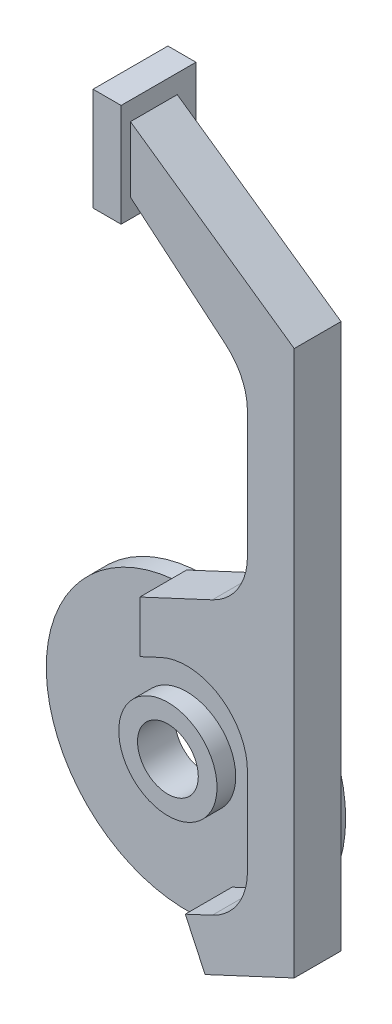
ISO-10303-21;
HEADER;
FILE_DESCRIPTION(('STEP AP214'),'2;1');
FILE_NAME('part.step','',(''),(''),'','','');
FILE_SCHEMA(('AUTOMOTIVE_DESIGN { 1 0 10303 214 1 1 1 1 }'));
ENDSEC;
DATA;
#1=APPLICATION_CONTEXT('core data for automotive mechanical design processes');
#2=APPLICATION_PROTOCOL_DEFINITION('international standard','automotive_design',2000,#1);
#3=PRODUCT_CONTEXT('',#1,'mechanical');
#4=PRODUCT('Part','Part','',(#3));
#5=PRODUCT_RELATED_PRODUCT_CATEGORY('part','',(#4));
#6=PRODUCT_DEFINITION_FORMATION('','',#4);
#7=PRODUCT_DEFINITION_CONTEXT('part definition',#1,'design');
#8=PRODUCT_DEFINITION('design','',#6,#7);
#9=PRODUCT_DEFINITION_SHAPE('','',#8);
#10=(LENGTH_UNIT() NAMED_UNIT(*) SI_UNIT(.MILLI.,.METRE.));
#11=(NAMED_UNIT(*) PLANE_ANGLE_UNIT() SI_UNIT($,.RADIAN.));
#12=(NAMED_UNIT(*) SI_UNIT($,.STERADIAN.) SOLID_ANGLE_UNIT());
#13=UNCERTAINTY_MEASURE_WITH_UNIT(LENGTH_MEASURE(1.E-05),#10,'distance_accuracy_value','');
#14=(GEOMETRIC_REPRESENTATION_CONTEXT(3) GLOBAL_UNCERTAINTY_ASSIGNED_CONTEXT((#13)) GLOBAL_UNIT_ASSIGNED_CONTEXT((#10,
#11,#12)) REPRESENTATION_CONTEXT('',''));
#15=CARTESIAN_POINT('',(0.,0.,0.));
#16=DIRECTION('',(0.,0.,1.));
#17=DIRECTION('',(1.,0.,0.));
#18=AXIS2_PLACEMENT_3D('',#15,#16,#17);
#19=CARTESIAN_POINT('',(0.,0.,4.));
#20=DIRECTION('',(0.,0.,-1.));
#21=DIRECTION('',(-1.,0.,0.));
#22=AXIS2_PLACEMENT_3D('',#19,#20,#21);
#23=CYLINDRICAL_SURFACE('',#22,30.);
#24=CARTESIAN_POINT('',(0.,0.,4.));
#25=DIRECTION('',(0.,0.,1.));
#26=DIRECTION('',(1.,0.,0.));
#27=AXIS2_PLACEMENT_3D('',#24,#25,#26);
#28=CIRCLE('',#27,30.);
#29=CARTESIAN_POINT('',(0.,30.,4.));
#30=VERTEX_POINT('',#29);
#31=CARTESIAN_POINT('',(12.678547852221,-27.1892336110995,4.));
#32=VERTEX_POINT('',#31);
#33=EDGE_CURVE('E53',#30,#32,#28,.T.);
#34=ORIENTED_EDGE('',*,*,#33,.F.);
#35=EDGE_CURVE('E334',#32,#30,#28,.T.);
#36=ORIENTED_EDGE('',*,*,#35,.F.);
#37=EDGE_LOOP('',(#34,#36));
#38=FACE_BOUND('',#37,.T.);
#39=CARTESIAN_POINT('',(0.,0.,0.));
#40=DIRECTION('',(0.,0.,1.));
#41=DIRECTION('',(1.,0.,0.));
#42=AXIS2_PLACEMENT_3D('',#39,#40,#41);
#43=CIRCLE('',#42,30.);
#44=CARTESIAN_POINT('',(30.,0.,0.));
#45=VERTEX_POINT('',#44);
#46=EDGE_CURVE('E333',#45,#45,#43,.T.);
#47=ORIENTED_EDGE('',*,*,#46,.T.);
#48=EDGE_LOOP('',(#47));
#49=FACE_BOUND('',#48,.T.);
#50=ADVANCED_FACE('F45',(#38,#49),#23,.T.);
#51=CARTESIAN_POINT('',(0.,0.,4.));
#52=DIRECTION('',(0.,0.,1.));
#53=DIRECTION('',(1.,0.,0.));
#54=AXIS2_PLACEMENT_3D('',#51,#52,#53);
#55=PLANE('',#54);
#56=CARTESIAN_POINT('',(0.,0.,4.));
#57=DIRECTION('',(0.,0.,1.));
#58=DIRECTION('',(1.,0.,0.));
#59=AXIS2_PLACEMENT_3D('',#56,#57,#58);
#60=CIRCLE('',#59,10.5);
#61=CARTESIAN_POINT('',(10.5,0.,4.));
#62=VERTEX_POINT('',#61);
#63=EDGE_CURVE('E494',#62,#62,#60,.T.);
#64=ORIENTED_EDGE('',*,*,#63,.F.);
#65=EDGE_LOOP('',(#64));
#66=FACE_BOUND('',#65,.T.);
#67=DIRECTION('',(0.,-1.,0.));
#68=VECTOR('',#67,1.);
#69=CARTESIAN_POINT('',(0.,33.,4.));
#70=LINE('',#69,#68);
#71=CARTESIAN_POINT('',(0.,21.9662208103751,4.));
#72=VERTEX_POINT('',#71);
#73=EDGE_CURVE('E11',#30,#72,#70,.T.);
#74=ORIENTED_EDGE('',*,*,#73,.F.);
#75=ORIENTED_EDGE('',*,*,#33,.T.);
#76=DIRECTION('',(0.422618261740701,-0.906307787036649,0.));
#77=VECTOR('',#76,1.);
#78=CARTESIAN_POINT('',(9.72022002003613,-20.8450791018429,4.));
#79=LINE('',#78,#77);
#80=CARTESIAN_POINT('',(9.72022002003613,-20.8450791018429,4.));
#81=VERTEX_POINT('',#80);
#82=EDGE_CURVE('E256',#81,#32,#79,.T.);
#83=ORIENTED_EDGE('',*,*,#82,.F.);
#84=DIRECTION('',(-0.906307787036648,-0.422618261740704,0.));
#85=VECTOR('',#84,1.);
#86=CARTESIAN_POINT('',(15.4940374026292,-18.1527038395513,4.));
#87=LINE('',#86,#85);
#88=CARTESIAN_POINT('',(15.4940374026292,-18.1527038395513,4.));
#89=VERTEX_POINT('',#88);
#90=EDGE_CURVE('E212',#89,#81,#87,.T.);
#91=ORIENTED_EDGE('',*,*,#90,.F.);
#92=CARTESIAN_POINT('',(10.,-6.37070260807489,4.));
#93=DIRECTION('',(0.,0.,-1.));
#94=DIRECTION('',(-1.,0.,0.));
#95=AXIS2_PLACEMENT_3D('',#92,#93,#94);
#96=CIRCLE('',#95,13.);
#97=CARTESIAN_POINT('',(23.,-6.37070260807489,4.));
#98=VERTEX_POINT('',#97);
#99=EDGE_CURVE('E225',#98,#89,#96,.T.);
#100=ORIENTED_EDGE('',*,*,#99,.F.);
#101=DIRECTION('',(0.,-1.,0.));
#102=VECTOR('',#101,1.);
#103=CARTESIAN_POINT('',(23.,12.2853844454127,4.));
#104=LINE('',#103,#102);
#105=CARTESIAN_POINT('',(23.,12.2853844454127,4.));
#106=VERTEX_POINT('',#105);
#107=EDGE_CURVE('E282',#106,#98,#104,.T.);
#108=ORIENTED_EDGE('',*,*,#107,.F.);
#109=CARTESIAN_POINT('',(10.,12.2853844454127,4.));
#110=DIRECTION('',(0.,0.,-1.));
#111=DIRECTION('',(-1.,0.,0.));
#112=AXIS2_PLACEMENT_3D('',#109,#110,#111);
#113=CIRCLE('',#112,13.);
#114=CARTESIAN_POINT('',(4.50596259737085,24.0673856768891,4.));
#115=VERTEX_POINT('',#114);
#116=EDGE_CURVE('E66',#115,#106,#113,.T.);
#117=ORIENTED_EDGE('',*,*,#116,.F.);
#118=DIRECTION('',(0.906307787036647,0.422618261740705,0.));
#119=VECTOR('',#118,1.);
#120=CARTESIAN_POINT('',(0.,21.9662208103751,4.));
#121=LINE('',#120,#119);
#122=EDGE_CURVE('E62',#72,#115,#121,.T.);
#123=ORIENTED_EDGE('',*,*,#122,.F.);
#124=EDGE_LOOP('',(#74,#75,#83,#91,#100,#108,#117,#123));
#125=FACE_BOUND('',#124,.T.);
#126=ADVANCED_FACE('F396',(#66,#125),#55,.T.);
#127=CARTESIAN_POINT('',(0.,0.,0.));
#128=DIRECTION('',(0.,0.,1.));
#129=DIRECTION('',(1.,0.,0.));
#130=AXIS2_PLACEMENT_3D('',#127,#128,#129);
#131=PLANE('',#130);
#132=CARTESIAN_POINT('',(0.,0.,0.));
#133=DIRECTION('',(0.,0.,1.));
#134=DIRECTION('',(1.,0.,0.));
#135=AXIS2_PLACEMENT_3D('',#132,#133,#134);
#136=CIRCLE('',#135,6.5);
#137=CARTESIAN_POINT('',(6.5,0.,0.));
#138=VERTEX_POINT('',#137);
#139=EDGE_CURVE('E492',#138,#138,#136,.T.);
#140=ORIENTED_EDGE('',*,*,#139,.T.);
#141=EDGE_LOOP('',(#140));
#142=FACE_BOUND('',#141,.T.);
#143=ORIENTED_EDGE('',*,*,#46,.F.);
#144=EDGE_LOOP('',(#143));
#145=FACE_BOUND('',#144,.T.);
#146=ADVANCED_FACE('F402',(#142,#145),#131,.F.);
#147=CARTESIAN_POINT('',(15.4940374026292,-18.1527038395513,14.));
#148=DIRECTION('',(0.422618261740704,-0.906307787036648,0.));
#149=DIRECTION('',(0.906307787036648,0.422618261740704,0.));
#150=AXIS2_PLACEMENT_3D('',#147,#148,#149);
#151=PLANE('',#150);
#152=ORIENTED_EDGE('',*,*,#90,.T.);
#153=DIRECTION('',(0.,0.,-1.));
#154=VECTOR('',#153,1.);
#155=CARTESIAN_POINT('',(9.72022002003613,-20.8450791018429,14.));
#156=LINE('',#155,#154);
#157=CARTESIAN_POINT('',(9.72022002003613,-20.8450791018429,14.));
#158=VERTEX_POINT('',#157);
#159=EDGE_CURVE('E330',#158,#81,#156,.T.);
#160=ORIENTED_EDGE('',*,*,#159,.F.);
#161=DIRECTION('',(-0.906307787036648,-0.422618261740704,0.));
#162=VECTOR('',#161,1.);
#163=CARTESIAN_POINT('',(15.4940374026292,-18.1527038395513,14.));
#164=LINE('',#163,#162);
#165=CARTESIAN_POINT('',(15.4940374026292,-18.1527038395513,14.));
#166=VERTEX_POINT('',#165);
#167=EDGE_CURVE('E221',#166,#158,#164,.T.);
#168=ORIENTED_EDGE('',*,*,#167,.F.);
#169=DIRECTION('',(0.,0.,-1.));
#170=VECTOR('',#169,1.);
#171=CARTESIAN_POINT('',(15.4940374026292,-18.1527038395513,14.));
#172=LINE('',#171,#170);
#173=EDGE_CURVE('E254',#166,#89,#172,.T.);
#174=ORIENTED_EDGE('',*,*,#173,.T.);
#175=EDGE_LOOP('',(#152,#160,#168,#174));
#176=FACE_BOUND('',#175,.T.);
#177=ADVANCED_FACE('F410',(#176),#151,.F.);
#178=CARTESIAN_POINT('',(9.72022002003613,-20.8450791018429,14.));
#179=DIRECTION('',(0.906307787036649,0.422618261740701,0.));
#180=DIRECTION('',(-0.422618261740701,0.906307787036649,0.));
#181=AXIS2_PLACEMENT_3D('',#178,#179,#180);
#182=PLANE('',#181);
#183=ORIENTED_EDGE('',*,*,#82,.T.);
#184=CARTESIAN_POINT('',(13.9464026374431,-29.9081569722094,4.));
#185=VERTEX_POINT('',#184);
#186=EDGE_CURVE('E215',#32,#185,#79,.T.);
#187=ORIENTED_EDGE('',*,*,#186,.T.);
#188=DIRECTION('',(0.,0.,-1.));
#189=VECTOR('',#188,1.);
#190=CARTESIAN_POINT('',(13.9464026374431,-29.9081569722094,14.));
#191=LINE('',#190,#189);
#192=CARTESIAN_POINT('',(13.9464026374431,-29.9081569722094,14.));
#193=VERTEX_POINT('',#192);
#194=EDGE_CURVE('E327',#193,#185,#191,.T.);
#195=ORIENTED_EDGE('',*,*,#194,.F.);
#196=DIRECTION('',(0.422618261740701,-0.906307787036649,0.));
#197=VECTOR('',#196,1.);
#198=CARTESIAN_POINT('',(9.72022002003613,-20.8450791018429,14.));
#199=LINE('',#198,#197);
#200=EDGE_CURVE('E224',#158,#193,#199,.T.);
#201=ORIENTED_EDGE('',*,*,#200,.F.);
#202=ORIENTED_EDGE('',*,*,#159,.T.);
#203=EDGE_LOOP('',(#183,#187,#195,#201,#202));
#204=FACE_BOUND('',#203,.T.);
#205=ADVANCED_FACE('F394',(#204),#182,.F.);
#206=CARTESIAN_POINT('',(13.9464026374431,-29.9081569722094,14.));
#207=DIRECTION('',(-0.422618261740704,0.906307787036648,0.));
#208=DIRECTION('',(-0.906307787036648,-0.422618261740704,0.));
#209=AXIS2_PLACEMENT_3D('',#206,#207,#208);
#210=PLANE('',#209);
#211=DIRECTION('',(0.906307787036648,0.422618261740704,0.));
#212=VECTOR('',#211,1.);
#213=CARTESIAN_POINT('',(13.9464026374431,-29.9081569722094,4.));
#214=LINE('',#213,#212);
#215=CARTESIAN_POINT('',(33.,-21.0233186066472,4.));
#216=VERTEX_POINT('',#215);
#217=EDGE_CURVE('E259',#185,#216,#214,.T.);
#218=ORIENTED_EDGE('',*,*,#217,.T.);
#219=DIRECTION('',(0.,0.,-1.));
#220=VECTOR('',#219,1.);
#221=CARTESIAN_POINT('',(33.,-21.0233186066472,14.));
#222=LINE('',#221,#220);
#223=CARTESIAN_POINT('',(33.,-21.0233186066472,14.));
#224=VERTEX_POINT('',#223);
#225=EDGE_CURVE('E324',#224,#216,#222,.T.);
#226=ORIENTED_EDGE('',*,*,#225,.F.);
#227=DIRECTION('',(0.906307787036648,0.422618261740704,0.));
#228=VECTOR('',#227,1.);
#229=CARTESIAN_POINT('',(13.9464026374431,-29.9081569722094,14.));
#230=LINE('',#229,#228);
#231=EDGE_CURVE('E227',#193,#224,#230,.T.);
#232=ORIENTED_EDGE('',*,*,#231,.F.);
#233=ORIENTED_EDGE('',*,*,#194,.T.);
#234=EDGE_LOOP('',(#218,#226,#232,#233));
#235=FACE_BOUND('',#234,.T.);
#236=ADVANCED_FACE('F391',(#235),#210,.F.);
#237=CARTESIAN_POINT('',(33.,-21.0233186066472,14.));
#238=DIRECTION('',(-1.,0.,0.));
#239=DIRECTION('',(0.,0.,1.));
#240=AXIS2_PLACEMENT_3D('',#237,#238,#239);
#241=PLANE('',#240);
#242=DIRECTION('',(0.,1.,0.));
#243=VECTOR('',#242,1.);
#244=CARTESIAN_POINT('',(33.,-21.0233186066472,4.));
#245=LINE('',#244,#243);
#246=CARTESIAN_POINT('',(33.,95.4927361626601,4.));
#247=VERTEX_POINT('',#246);
#248=EDGE_CURVE('E261',#216,#247,#245,.T.);
#249=ORIENTED_EDGE('',*,*,#248,.T.);
#250=DIRECTION('',(0.,0.,-1.));
#251=VECTOR('',#250,1.);
#252=CARTESIAN_POINT('',(33.,95.4927361626601,14.));
#253=LINE('',#252,#251);
#254=CARTESIAN_POINT('',(33.,95.4927361626601,14.));
#255=VERTEX_POINT('',#254);
#256=EDGE_CURVE('E321',#255,#247,#253,.T.);
#257=ORIENTED_EDGE('',*,*,#256,.F.);
#258=DIRECTION('',(0.,1.,0.));
#259=VECTOR('',#258,1.);
#260=CARTESIAN_POINT('',(33.,-21.0233186066472,14.));
#261=LINE('',#260,#259);
#262=EDGE_CURVE('E229',#224,#255,#261,.T.);
#263=ORIENTED_EDGE('',*,*,#262,.F.);
#264=ORIENTED_EDGE('',*,*,#225,.T.);
#265=EDGE_LOOP('',(#249,#257,#263,#264));
#266=FACE_BOUND('',#265,.T.);
#267=ADVANCED_FACE('F386',(#266),#241,.F.);
#268=CARTESIAN_POINT('',(33.,95.4927361626601,14.));
#269=DIRECTION('',(-0.573576436351047,-0.819152044288991,0.));
#270=DIRECTION('',(0.819152044288991,-0.573576436351047,0.));
#271=AXIS2_PLACEMENT_3D('',#268,#269,#270);
#272=PLANE('',#271);
#273=DIRECTION('',(-0.819152044288991,0.573576436351047,0.));
#274=VECTOR('',#273,1.);
#275=CARTESIAN_POINT('',(33.,95.4927361626601,4.));
#276=LINE('',#275,#274);
#277=CARTESIAN_POINT('',(-2.,120.,4.));
#278=VERTEX_POINT('',#277);
#279=EDGE_CURVE('E263',#247,#278,#276,.T.);
#280=ORIENTED_EDGE('',*,*,#279,.T.);
#281=DIRECTION('',(0.,0.,-1.));
#282=VECTOR('',#281,1.);
#283=CARTESIAN_POINT('',(-2.,120.,14.));
#284=LINE('',#283,#282);
#285=CARTESIAN_POINT('',(-2.,120.,14.));
#286=VERTEX_POINT('',#285);
#287=EDGE_CURVE('E318',#286,#278,#284,.T.);
#288=ORIENTED_EDGE('',*,*,#287,.F.);
#289=DIRECTION('',(-0.819152044288991,0.573576436351047,0.));
#290=VECTOR('',#289,1.);
#291=CARTESIAN_POINT('',(33.,95.4927361626601,14.));
#292=LINE('',#291,#290);
#293=EDGE_CURVE('E231',#255,#286,#292,.T.);
#294=ORIENTED_EDGE('',*,*,#293,.F.);
#295=ORIENTED_EDGE('',*,*,#256,.T.);
#296=EDGE_LOOP('',(#280,#288,#294,#295));
#297=FACE_BOUND('',#296,.T.);
#298=ADVANCED_FACE('F382',(#297),#272,.F.);
#299=CARTESIAN_POINT('',(-2.,106.,14.));
#300=DIRECTION('',(0.642787609686535,0.766044443118982,0.));
#301=DIRECTION('',(-0.766044443118982,0.642787609686535,0.));
#302=AXIS2_PLACEMENT_3D('',#299,#300,#301);
#303=PLANE('',#302);
#304=DIRECTION('',(0.766044443118982,-0.642787609686535,0.));
#305=VECTOR('',#304,1.);
#306=CARTESIAN_POINT('',(-2.,106.,4.));
#307=LINE('',#306,#305);
#308=CARTESIAN_POINT('',(-2.,106.,4.));
#309=VERTEX_POINT('',#308);
#310=CARTESIAN_POINT('',(18.3562389259249,88.9190874251,4.));
#311=VERTEX_POINT('',#310);
#312=EDGE_CURVE('E269',#309,#311,#307,.T.);
#313=ORIENTED_EDGE('',*,*,#312,.T.);
#314=DIRECTION('',(0.,0.,-1.));
#315=VECTOR('',#314,1.);
#316=CARTESIAN_POINT('',(18.3562389259249,88.9190874251,14.));
#317=LINE('',#316,#315);
#318=CARTESIAN_POINT('',(18.3562389259249,88.9190874251,14.));
#319=VERTEX_POINT('',#318);
#320=EDGE_CURVE('E313',#319,#311,#317,.T.);
#321=ORIENTED_EDGE('',*,*,#320,.F.);
#322=DIRECTION('',(0.766044443118982,-0.642787609686535,0.));
#323=VECTOR('',#322,1.);
#324=CARTESIAN_POINT('',(-2.,106.,14.));
#325=LINE('',#324,#323);
#326=CARTESIAN_POINT('',(-2.,106.,14.));
#327=VERTEX_POINT('',#326);
#328=EDGE_CURVE('E235',#327,#319,#325,.T.);
#329=ORIENTED_EDGE('',*,*,#328,.F.);
#330=DIRECTION('',(0.,0.,-1.));
#331=VECTOR('',#330,1.);
#332=CARTESIAN_POINT('',(-2.,106.,14.));
#333=LINE('',#332,#331);
#334=EDGE_CURVE('E316',#327,#309,#333,.T.);
#335=ORIENTED_EDGE('',*,*,#334,.T.);
#336=EDGE_LOOP('',(#313,#321,#329,#335));
#337=FACE_BOUND('',#336,.T.);
#338=ADVANCED_FACE('F424',(#337),#303,.F.);
#339=CARTESIAN_POINT('',(9.99999999999999,78.9605096645532,14.));
#340=DIRECTION('',(0.,0.,-1.));
#341=DIRECTION('',(-1.,0.,0.));
#342=AXIS2_PLACEMENT_3D('',#339,#340,#341);
#343=CYLINDRICAL_SURFACE('',#342,13.);
#344=CARTESIAN_POINT('',(9.99999999999999,78.9605096645532,4.));
#345=DIRECTION('',(0.,0.,-1.));
#346=DIRECTION('',(-1.,0.,0.));
#347=AXIS2_PLACEMENT_3D('',#344,#345,#346);
#348=CIRCLE('',#347,13.);
#349=CARTESIAN_POINT('',(23.,78.9605096645532,4.));
#350=VERTEX_POINT('',#349);
#351=EDGE_CURVE('E271',#311,#350,#348,.T.);
#352=ORIENTED_EDGE('',*,*,#351,.T.);
#353=DIRECTION('',(0.,0.,-1.));
#354=VECTOR('',#353,1.);
#355=CARTESIAN_POINT('',(23.,78.9605096645532,14.));
#356=LINE('',#355,#354);
#357=CARTESIAN_POINT('',(23.,78.9605096645532,14.));
#358=VERTEX_POINT('',#357);
#359=EDGE_CURVE('E310',#358,#350,#356,.T.);
#360=ORIENTED_EDGE('',*,*,#359,.F.);
#361=CARTESIAN_POINT('',(9.99999999999999,78.9605096645532,14.));
#362=DIRECTION('',(0.,0.,-1.));
#363=DIRECTION('',(-1.,0.,0.));
#364=AXIS2_PLACEMENT_3D('',#361,#362,#363);
#365=CIRCLE('',#364,13.);
#366=EDGE_CURVE('E237',#319,#358,#365,.T.);
#367=ORIENTED_EDGE('',*,*,#366,.F.);
#368=ORIENTED_EDGE('',*,*,#320,.T.);
#369=EDGE_LOOP('',(#352,#360,#367,#368));
#370=FACE_BOUND('',#369,.T.);
#371=ADVANCED_FACE('F370',(#370),#343,.F.);
#372=CARTESIAN_POINT('',(23.,78.9605096645532,14.));
#373=DIRECTION('',(1.,0.,0.));
#374=DIRECTION('',(0.,0.,-1.));
#375=AXIS2_PLACEMENT_3D('',#372,#373,#374);
#376=PLANE('',#375);
#377=DIRECTION('',(0.,-1.,0.));
#378=VECTOR('',#377,1.);
#379=CARTESIAN_POINT('',(23.,78.9605096645532,4.));
#380=LINE('',#379,#378);
#381=CARTESIAN_POINT('',(23.,52.0069895280625,4.));
#382=VERTEX_POINT('',#381);
#383=EDGE_CURVE('E273',#350,#382,#380,.T.);
#384=ORIENTED_EDGE('',*,*,#383,.T.);
#385=DIRECTION('',(0.,0.,-1.));
#386=VECTOR('',#385,1.);
#387=CARTESIAN_POINT('',(23.,52.0069895280625,14.));
#388=LINE('',#387,#386);
#389=CARTESIAN_POINT('',(23.,52.0069895280625,14.));
#390=VERTEX_POINT('',#389);
#391=EDGE_CURVE('E307',#390,#382,#388,.T.);
#392=ORIENTED_EDGE('',*,*,#391,.F.);
#393=DIRECTION('',(0.,-1.,0.));
#394=VECTOR('',#393,1.);
#395=CARTESIAN_POINT('',(23.,78.9605096645532,14.));
#396=LINE('',#395,#394);
#397=EDGE_CURVE('E239',#358,#390,#396,.T.);
#398=ORIENTED_EDGE('',*,*,#397,.F.);
#399=ORIENTED_EDGE('',*,*,#359,.T.);
#400=EDGE_LOOP('',(#384,#392,#398,#399));
#401=FACE_BOUND('',#400,.T.);
#402=ADVANCED_FACE('F366',(#401),#376,.F.);
#403=CARTESIAN_POINT('',(9.99999999999999,52.0069895280625,14.));
#404=DIRECTION('',(0.,0.,-1.));
#405=DIRECTION('',(-1.,0.,0.));
#406=AXIS2_PLACEMENT_3D('',#403,#404,#405);
#407=CYLINDRICAL_SURFACE('',#406,13.);
#408=CARTESIAN_POINT('',(9.99999999999999,52.0069895280625,4.));
#409=DIRECTION('',(0.,0.,-1.));
#410=DIRECTION('',(-1.,0.,0.));
#411=AXIS2_PLACEMENT_3D('',#408,#409,#410);
#412=CIRCLE('',#411,13.);
#413=CARTESIAN_POINT('',(15.4940374026291,40.224988296586,4.));
#414=VERTEX_POINT('',#413);
#415=EDGE_CURVE('E275',#382,#414,#412,.T.);
#416=ORIENTED_EDGE('',*,*,#415,.T.);
#417=DIRECTION('',(0.,0.,-1.));
#418=VECTOR('',#417,1.);
#419=CARTESIAN_POINT('',(15.4940374026291,40.224988296586,14.));
#420=LINE('',#419,#418);
#421=CARTESIAN_POINT('',(15.4940374026291,40.224988296586,14.));
#422=VERTEX_POINT('',#421);
#423=EDGE_CURVE('E304',#422,#414,#420,.T.);
#424=ORIENTED_EDGE('',*,*,#423,.F.);
#425=CARTESIAN_POINT('',(9.99999999999999,52.0069895280625,14.));
#426=DIRECTION('',(0.,0.,-1.));
#427=DIRECTION('',(-1.,0.,0.));
#428=AXIS2_PLACEMENT_3D('',#425,#426,#427);
#429=CIRCLE('',#428,13.);
#430=EDGE_CURVE('E241',#390,#422,#429,.T.);
#431=ORIENTED_EDGE('',*,*,#430,.F.);
#432=ORIENTED_EDGE('',*,*,#391,.T.);
#433=EDGE_LOOP('',(#416,#424,#431,#432));
#434=FACE_BOUND('',#433,.T.);
#435=ADVANCED_FACE('F361',(#434),#407,.F.);
#436=CARTESIAN_POINT('',(15.4940374026291,40.224988296586,14.));
#437=DIRECTION('',(0.422618261740704,-0.906307787036648,0.));
#438=DIRECTION('',(0.906307787036648,0.422618261740704,0.));
#439=AXIS2_PLACEMENT_3D('',#436,#437,#438);
#440=PLANE('',#439);
#441=DIRECTION('',(-0.906307787036648,-0.422618261740704,0.));
#442=VECTOR('',#441,1.);
#443=CARTESIAN_POINT('',(15.4940374026291,40.224988296586,4.));
#444=LINE('',#443,#442);
#445=CARTESIAN_POINT('',(0.,33.,4.));
#446=VERTEX_POINT('',#445);
#447=EDGE_CURVE('E277',#414,#446,#444,.T.);
#448=ORIENTED_EDGE('',*,*,#447,.T.);
#449=DIRECTION('',(0.,0.,-1.));
#450=VECTOR('',#449,1.);
#451=CARTESIAN_POINT('',(0.,33.,14.));
#452=LINE('',#451,#450);
#453=CARTESIAN_POINT('',(0.,33.,14.));
#454=VERTEX_POINT('',#453);
#455=EDGE_CURVE('E301',#454,#446,#452,.T.);
#456=ORIENTED_EDGE('',*,*,#455,.F.);
#457=DIRECTION('',(-0.906307787036648,-0.422618261740704,0.));
#458=VECTOR('',#457,1.);
#459=CARTESIAN_POINT('',(15.4940374026291,40.224988296586,14.));
#460=LINE('',#459,#458);
#461=EDGE_CURVE('E243',#422,#454,#460,.T.);
#462=ORIENTED_EDGE('',*,*,#461,.F.);
#463=ORIENTED_EDGE('',*,*,#423,.T.);
#464=EDGE_LOOP('',(#448,#456,#462,#463));
#465=FACE_BOUND('',#464,.T.);
#466=ADVANCED_FACE('F355',(#465),#440,.F.);
#467=CARTESIAN_POINT('',(0.,33.,14.));
#468=DIRECTION('',(1.,0.,0.));
#469=DIRECTION('',(0.,1.,0.));
#470=AXIS2_PLACEMENT_3D('',#467,#468,#469);
#471=PLANE('',#470);
#472=EDGE_CURVE('E55',#446,#30,#70,.T.);
#473=ORIENTED_EDGE('',*,*,#472,.T.);
#474=ORIENTED_EDGE('',*,*,#73,.T.);
#475=DIRECTION('',(0.,0.,-1.));
#476=VECTOR('',#475,1.);
#477=CARTESIAN_POINT('',(0.,21.9662208103751,14.));
#478=LINE('',#477,#476);
#479=CARTESIAN_POINT('',(0.,21.9662208103751,14.));
#480=VERTEX_POINT('',#479);
#481=EDGE_CURVE('E298',#480,#72,#478,.T.);
#482=ORIENTED_EDGE('',*,*,#481,.F.);
#483=DIRECTION('',(0.,-1.,0.));
#484=VECTOR('',#483,1.);
#485=CARTESIAN_POINT('',(0.,33.,14.));
#486=LINE('',#485,#484);
#487=EDGE_CURVE('E245',#454,#480,#486,.T.);
#488=ORIENTED_EDGE('',*,*,#487,.F.);
#489=ORIENTED_EDGE('',*,*,#455,.T.);
#490=EDGE_LOOP('',(#473,#474,#482,#488,#489));
#491=FACE_BOUND('',#490,.T.);
#492=ADVANCED_FACE('F349',(#491),#471,.F.);
#493=CARTESIAN_POINT('',(0.,21.9662208103751,14.));
#494=DIRECTION('',(-0.422618261740705,0.906307787036647,0.));
#495=DIRECTION('',(-0.906307787036647,-0.422618261740705,0.));
#496=AXIS2_PLACEMENT_3D('',#493,#494,#495);
#497=PLANE('',#496);
#498=ORIENTED_EDGE('',*,*,#122,.T.);
#499=DIRECTION('',(0.,0.,-1.));
#500=VECTOR('',#499,1.);
#501=CARTESIAN_POINT('',(4.50596259737085,24.0673856768891,14.));
#502=LINE('',#501,#500);
#503=CARTESIAN_POINT('',(4.50596259737085,24.0673856768891,14.));
#504=VERTEX_POINT('',#503);
#505=EDGE_CURVE('E295',#504,#115,#502,.T.);
#506=ORIENTED_EDGE('',*,*,#505,.F.);
#507=DIRECTION('',(0.906307787036647,0.422618261740705,0.));
#508=VECTOR('',#507,1.);
#509=CARTESIAN_POINT('',(0.,21.9662208103751,14.));
#510=LINE('',#509,#508);
#511=EDGE_CURVE('E247',#480,#504,#510,.T.);
#512=ORIENTED_EDGE('',*,*,#511,.F.);
#513=ORIENTED_EDGE('',*,*,#481,.T.);
#514=EDGE_LOOP('',(#498,#506,#512,#513));
#515=FACE_BOUND('',#514,.T.);
#516=ADVANCED_FACE('F437',(#515),#497,.F.);
#517=CARTESIAN_POINT('',(10.,12.2853844454127,14.));
#518=DIRECTION('',(0.,0.,-1.));
#519=DIRECTION('',(-1.,0.,0.));
#520=AXIS2_PLACEMENT_3D('',#517,#518,#519);
#521=CYLINDRICAL_SURFACE('',#520,13.);
#522=ORIENTED_EDGE('',*,*,#116,.T.);
#523=DIRECTION('',(0.,0.,-1.));
#524=VECTOR('',#523,1.);
#525=CARTESIAN_POINT('',(23.,12.2853844454127,14.));
#526=LINE('',#525,#524);
#527=CARTESIAN_POINT('',(23.,12.2853844454127,14.));
#528=VERTEX_POINT('',#527);
#529=EDGE_CURVE('E292',#528,#106,#526,.T.);
#530=ORIENTED_EDGE('',*,*,#529,.F.);
#531=CARTESIAN_POINT('',(10.,12.2853844454127,14.));
#532=DIRECTION('',(0.,0.,-1.));
#533=DIRECTION('',(-1.,0.,0.));
#534=AXIS2_PLACEMENT_3D('',#531,#532,#533);
#535=CIRCLE('',#534,13.);
#536=EDGE_CURVE('E249',#504,#528,#535,.T.);
#537=ORIENTED_EDGE('',*,*,#536,.F.);
#538=ORIENTED_EDGE('',*,*,#505,.T.);
#539=EDGE_LOOP('',(#522,#530,#537,#538));
#540=FACE_BOUND('',#539,.T.);
#541=ADVANCED_FACE('F440',(#540),#521,.F.);
#542=CARTESIAN_POINT('',(23.,12.2853844454127,14.));
#543=DIRECTION('',(1.,0.,0.));
#544=DIRECTION('',(0.,0.,-1.));
#545=AXIS2_PLACEMENT_3D('',#542,#543,#544);
#546=PLANE('',#545);
#547=ORIENTED_EDGE('',*,*,#107,.T.);
#548=DIRECTION('',(0.,0.,-1.));
#549=VECTOR('',#548,1.);
#550=CARTESIAN_POINT('',(23.,-6.37070260807489,14.));
#551=LINE('',#550,#549);
#552=CARTESIAN_POINT('',(23.,-6.37070260807489,14.));
#553=VERTEX_POINT('',#552);
#554=EDGE_CURVE('E289',#553,#98,#551,.T.);
#555=ORIENTED_EDGE('',*,*,#554,.F.);
#556=DIRECTION('',(0.,-1.,0.));
#557=VECTOR('',#556,1.);
#558=CARTESIAN_POINT('',(23.,12.2853844454127,14.));
#559=LINE('',#558,#557);
#560=EDGE_CURVE('E251',#528,#553,#559,.T.);
#561=ORIENTED_EDGE('',*,*,#560,.F.);
#562=ORIENTED_EDGE('',*,*,#529,.T.);
#563=EDGE_LOOP('',(#547,#555,#561,#562));
#564=FACE_BOUND('',#563,.T.);
#565=ADVANCED_FACE('F444',(#564),#546,.F.);
#566=CARTESIAN_POINT('',(10.,-6.37070260807489,14.));
#567=DIRECTION('',(0.,0.,-1.));
#568=DIRECTION('',(-1.,0.,0.));
#569=AXIS2_PLACEMENT_3D('',#566,#567,#568);
#570=CYLINDRICAL_SURFACE('',#569,13.);
#571=ORIENTED_EDGE('',*,*,#99,.T.);
#572=ORIENTED_EDGE('',*,*,#173,.F.);
#573=CARTESIAN_POINT('',(10.,-6.37070260807489,14.));
#574=DIRECTION('',(0.,0.,-1.));
#575=DIRECTION('',(-1.,0.,0.));
#576=AXIS2_PLACEMENT_3D('',#573,#574,#575);
#577=CIRCLE('',#576,13.);
#578=EDGE_CURVE('E253',#553,#166,#577,.T.);
#579=ORIENTED_EDGE('',*,*,#578,.F.);
#580=ORIENTED_EDGE('',*,*,#554,.T.);
#581=EDGE_LOOP('',(#571,#572,#579,#580));
#582=FACE_BOUND('',#581,.T.);
#583=ADVANCED_FACE('F448',(#582),#570,.F.);
#584=CARTESIAN_POINT('',(9.99999999999999,78.9605096645532,14.));
#585=DIRECTION('',(0.,0.,-1.));
#586=DIRECTION('',(-1.,0.,0.));
#587=AXIS2_PLACEMENT_3D('',#584,#585,#586);
#588=PLANE('',#587);
#589=ORIENTED_EDGE('',*,*,#167,.T.);
#590=ORIENTED_EDGE('',*,*,#200,.T.);
#591=ORIENTED_EDGE('',*,*,#231,.T.);
#592=ORIENTED_EDGE('',*,*,#262,.T.);
#593=ORIENTED_EDGE('',*,*,#293,.T.);
#594=DIRECTION('',(0.,-1.,0.));
#595=VECTOR('',#594,1.);
#596=CARTESIAN_POINT('',(-2.,120.,14.));
#597=LINE('',#596,#595);
#598=EDGE_CURVE('E233',#286,#327,#597,.T.);
#599=ORIENTED_EDGE('',*,*,#598,.T.);
#600=ORIENTED_EDGE('',*,*,#328,.T.);
#601=ORIENTED_EDGE('',*,*,#366,.T.);
#602=ORIENTED_EDGE('',*,*,#397,.T.);
#603=ORIENTED_EDGE('',*,*,#430,.T.);
#604=ORIENTED_EDGE('',*,*,#461,.T.);
#605=ORIENTED_EDGE('',*,*,#487,.T.);
#606=ORIENTED_EDGE('',*,*,#511,.T.);
#607=ORIENTED_EDGE('',*,*,#536,.T.);
#608=ORIENTED_EDGE('',*,*,#560,.T.);
#609=ORIENTED_EDGE('',*,*,#578,.T.);
#610=EDGE_LOOP('',(#589,#590,#591,#592,#593,#599,#600,#601,#602,#603,#604,#605,#606,#607,#608,#609));
#611=FACE_BOUND('',#610,.T.);
#612=ADVANCED_FACE('F452',(#611),#588,.F.);
#613=CARTESIAN_POINT('',(9.99999999999999,78.9605096645532,4.));
#614=DIRECTION('',(0.,0.,-1.));
#615=DIRECTION('',(-1.,0.,0.));
#616=AXIS2_PLACEMENT_3D('',#613,#614,#615);
#617=PLANE('',#616);
#618=ORIENTED_EDGE('',*,*,#186,.F.);
#619=ORIENTED_EDGE('',*,*,#35,.T.);
#620=ORIENTED_EDGE('',*,*,#472,.F.);
#621=ORIENTED_EDGE('',*,*,#447,.F.);
#622=ORIENTED_EDGE('',*,*,#415,.F.);
#623=ORIENTED_EDGE('',*,*,#383,.F.);
#624=ORIENTED_EDGE('',*,*,#351,.F.);
#625=ORIENTED_EDGE('',*,*,#312,.F.);
#626=DIRECTION('',(0.,-1.,0.));
#627=VECTOR('',#626,1.);
#628=CARTESIAN_POINT('',(-2.,120.,4.));
#629=LINE('',#628,#627);
#630=EDGE_CURVE('E266',#278,#309,#629,.T.);
#631=ORIENTED_EDGE('',*,*,#630,.F.);
#632=ORIENTED_EDGE('',*,*,#279,.F.);
#633=ORIENTED_EDGE('',*,*,#248,.F.);
#634=ORIENTED_EDGE('',*,*,#217,.F.);
#635=EDGE_LOOP('',(#618,#619,#620,#621,#622,#623,#624,#625,#631,#632,#633,#634));
#636=FACE_BOUND('',#635,.T.);
#637=ADVANCED_FACE('F343',(#636),#617,.T.);
#638=CARTESIAN_POINT('',(-2.,0.,0.));
#639=DIRECTION('',(-1.,0.,0.));
#640=DIRECTION('',(0.,-1.,0.));
#641=AXIS2_PLACEMENT_3D('',#638,#639,#640);
#642=PLANE('',#641);
#643=DIRECTION('',(0.,0.,1.));
#644=VECTOR('',#643,1.);
#645=CARTESIAN_POINT('',(-2.00000000000001,102.,16.));
#646=LINE('',#645,#644);
#647=CARTESIAN_POINT('',(-2.00000000000001,102.,0.));
#648=VERTEX_POINT('',#647);
#649=CARTESIAN_POINT('',(-2.00000000000001,102.,16.));
#650=VERTEX_POINT('',#649);
#651=EDGE_CURVE('E211',#648,#650,#646,.T.);
#652=ORIENTED_EDGE('',*,*,#651,.F.);
#653=DIRECTION('',(0.,-1.,0.));
#654=VECTOR('',#653,1.);
#655=CARTESIAN_POINT('',(-2.00000000000001,124.,0.));
#656=LINE('',#655,#654);
#657=CARTESIAN_POINT('',(-2.00000000000001,124.,0.));
#658=VERTEX_POINT('',#657);
#659=EDGE_CURVE('E207',#658,#648,#656,.T.);
#660=ORIENTED_EDGE('',*,*,#659,.F.);
#661=DIRECTION('',(0.,0.,-1.));
#662=VECTOR('',#661,1.);
#663=CARTESIAN_POINT('',(-2.00000000000001,124.,16.));
#664=LINE('',#663,#662);
#665=CARTESIAN_POINT('',(-2.00000000000001,124.,16.));
#666=VERTEX_POINT('',#665);
#667=EDGE_CURVE('E507',#666,#658,#664,.T.);
#668=ORIENTED_EDGE('',*,*,#667,.F.);
#669=DIRECTION('',(0.,1.,0.));
#670=VECTOR('',#669,1.);
#671=CARTESIAN_POINT('',(-2.00000000000001,124.,16.));
#672=LINE('',#671,#670);
#673=EDGE_CURVE('E505',#650,#666,#672,.T.);
#674=ORIENTED_EDGE('',*,*,#673,.F.);
#675=EDGE_LOOP('',(#652,#660,#668,#674));
#676=FACE_BOUND('',#675,.T.);
#677=ORIENTED_EDGE('',*,*,#287,.T.);
#678=ORIENTED_EDGE('',*,*,#630,.T.);
#679=ORIENTED_EDGE('',*,*,#334,.F.);
#680=ORIENTED_EDGE('',*,*,#598,.F.);
#681=EDGE_LOOP('',(#677,#678,#679,#680));
#682=FACE_BOUND('',#681,.T.);
#683=ADVANCED_FACE('F377',(#676,#682),#642,.F.);
#684=CARTESIAN_POINT('',(-8.00000000000001,102.,16.));
#685=DIRECTION('',(0.,1.,0.));
#686=DIRECTION('',(-1.,0.,0.));
#687=AXIS2_PLACEMENT_3D('',#684,#685,#686);
#688=PLANE('',#687);
#689=ORIENTED_EDGE('',*,*,#651,.T.);
#690=DIRECTION('',(1.,0.,0.));
#691=VECTOR('',#690,1.);
#692=CARTESIAN_POINT('',(-8.00000000000001,102.,16.));
#693=LINE('',#692,#691);
#694=CARTESIAN_POINT('',(-8.00000000000001,102.,16.));
#695=VERTEX_POINT('',#694);
#696=EDGE_CURVE('E191',#695,#650,#693,.T.);
#697=ORIENTED_EDGE('',*,*,#696,.F.);
#698=DIRECTION('',(0.,0.,1.));
#699=VECTOR('',#698,1.);
#700=CARTESIAN_POINT('',(-8.00000000000001,102.,16.));
#701=LINE('',#700,#699);
#702=CARTESIAN_POINT('',(-8.00000000000001,102.,0.));
#703=VERTEX_POINT('',#702);
#704=EDGE_CURVE('E198',#703,#695,#701,.T.);
#705=ORIENTED_EDGE('',*,*,#704,.F.);
#706=DIRECTION('',(1.,0.,0.));
#707=VECTOR('',#706,1.);
#708=CARTESIAN_POINT('',(-8.00000000000001,102.,0.));
#709=LINE('',#708,#707);
#710=EDGE_CURVE('E503',#703,#648,#709,.T.);
#711=ORIENTED_EDGE('',*,*,#710,.T.);
#712=EDGE_LOOP('',(#689,#697,#705,#711));
#713=FACE_BOUND('',#712,.T.);
#714=ADVANCED_FACE('F209',(#713),#688,.F.);
#715=CARTESIAN_POINT('',(-8.00000000000001,124.,16.));
#716=DIRECTION('',(0.,0.,-1.));
#717=DIRECTION('',(-1.,0.,0.));
#718=AXIS2_PLACEMENT_3D('',#715,#716,#717);
#719=PLANE('',#718);
#720=ORIENTED_EDGE('',*,*,#673,.T.);
#721=DIRECTION('',(1.,0.,0.));
#722=VECTOR('',#721,1.);
#723=CARTESIAN_POINT('',(-8.00000000000001,124.,16.));
#724=LINE('',#723,#722);
#725=CARTESIAN_POINT('',(-8.00000000000001,124.,16.));
#726=VERTEX_POINT('',#725);
#727=EDGE_CURVE('E194',#726,#666,#724,.T.);
#728=ORIENTED_EDGE('',*,*,#727,.F.);
#729=DIRECTION('',(0.,1.,0.));
#730=VECTOR('',#729,1.);
#731=CARTESIAN_POINT('',(-8.00000000000001,124.,16.));
#732=LINE('',#731,#730);
#733=EDGE_CURVE('E187',#695,#726,#732,.T.);
#734=ORIENTED_EDGE('',*,*,#733,.F.);
#735=ORIENTED_EDGE('',*,*,#696,.T.);
#736=EDGE_LOOP('',(#720,#728,#734,#735));
#737=FACE_BOUND('',#736,.T.);
#738=ADVANCED_FACE('F189',(#737),#719,.F.);
#739=CARTESIAN_POINT('',(-8.00000000000001,124.,16.));
#740=DIRECTION('',(0.,-1.,0.));
#741=DIRECTION('',(1.,0.,0.));
#742=AXIS2_PLACEMENT_3D('',#739,#740,#741);
#743=PLANE('',#742);
#744=ORIENTED_EDGE('',*,*,#667,.T.);
#745=DIRECTION('',(1.,0.,0.));
#746=VECTOR('',#745,1.);
#747=CARTESIAN_POINT('',(-8.00000000000001,124.,0.));
#748=LINE('',#747,#746);
#749=CARTESIAN_POINT('',(-8.00000000000001,124.,0.));
#750=VERTEX_POINT('',#749);
#751=EDGE_CURVE('E217',#750,#658,#748,.T.);
#752=ORIENTED_EDGE('',*,*,#751,.F.);
#753=DIRECTION('',(0.,0.,-1.));
#754=VECTOR('',#753,1.);
#755=CARTESIAN_POINT('',(-8.00000000000001,124.,16.));
#756=LINE('',#755,#754);
#757=EDGE_CURVE('E197',#726,#750,#756,.T.);
#758=ORIENTED_EDGE('',*,*,#757,.F.);
#759=ORIENTED_EDGE('',*,*,#727,.T.);
#760=EDGE_LOOP('',(#744,#752,#758,#759));
#761=FACE_BOUND('',#760,.T.);
#762=ADVANCED_FACE('F463',(#761),#743,.F.);
#763=CARTESIAN_POINT('',(-8.00000000000001,124.,0.));
#764=DIRECTION('',(0.,0.,1.));
#765=DIRECTION('',(1.,0.,0.));
#766=AXIS2_PLACEMENT_3D('',#763,#764,#765);
#767=PLANE('',#766);
#768=ORIENTED_EDGE('',*,*,#659,.T.);
#769=ORIENTED_EDGE('',*,*,#710,.F.);
#770=DIRECTION('',(0.,-1.,0.));
#771=VECTOR('',#770,1.);
#772=CARTESIAN_POINT('',(-8.00000000000001,124.,0.));
#773=LINE('',#772,#771);
#774=EDGE_CURVE('E203',#750,#703,#773,.T.);
#775=ORIENTED_EDGE('',*,*,#774,.F.);
#776=ORIENTED_EDGE('',*,*,#751,.T.);
#777=EDGE_LOOP('',(#768,#769,#775,#776));
#778=FACE_BOUND('',#777,.T.);
#779=ADVANCED_FACE('F466',(#778),#767,.F.);
#780=CARTESIAN_POINT('',(-8.00000000000001,0.,0.));
#781=DIRECTION('',(-1.,0.,0.));
#782=DIRECTION('',(0.,-1.,0.));
#783=AXIS2_PLACEMENT_3D('',#780,#781,#782);
#784=PLANE('',#783);
#785=ORIENTED_EDGE('',*,*,#704,.T.);
#786=ORIENTED_EDGE('',*,*,#733,.T.);
#787=ORIENTED_EDGE('',*,*,#757,.T.);
#788=ORIENTED_EDGE('',*,*,#774,.T.);
#789=EDGE_LOOP('',(#785,#786,#787,#788));
#790=FACE_BOUND('',#789,.T.);
#791=ADVANCED_FACE('F201',(#790),#784,.T.);
#792=CARTESIAN_POINT('',(0.,0.,8.));
#793=DIRECTION('',(0.,0.,-1.));
#794=DIRECTION('',(-1.,0.,0.));
#795=AXIS2_PLACEMENT_3D('',#792,#793,#794);
#796=CYLINDRICAL_SURFACE('',#795,10.5);
#797=CARTESIAN_POINT('',(0.,0.,8.));
#798=DIRECTION('',(0.,0.,1.));
#799=DIRECTION('',(1.,0.,0.));
#800=AXIS2_PLACEMENT_3D('',#797,#798,#799);
#801=CIRCLE('',#800,10.5);
#802=CARTESIAN_POINT('',(10.5,0.,8.));
#803=VERTEX_POINT('',#802);
#804=EDGE_CURVE('E496',#803,#803,#801,.T.);
#805=ORIENTED_EDGE('',*,*,#804,.F.);
#806=EDGE_LOOP('',(#805));
#807=FACE_BOUND('',#806,.T.);
#808=ORIENTED_EDGE('',*,*,#63,.T.);
#809=EDGE_LOOP('',(#808));
#810=FACE_BOUND('',#809,.T.);
#811=ADVANCED_FACE('F475',(#807,#810),#796,.T.);
#812=CARTESIAN_POINT('',(0.,0.,8.));
#813=DIRECTION('',(0.,0.,1.));
#814=DIRECTION('',(1.,0.,0.));
#815=AXIS2_PLACEMENT_3D('',#812,#813,#814);
#816=PLANE('',#815);
#817=CARTESIAN_POINT('',(0.,0.,8.));
#818=DIRECTION('',(0.,0.,1.));
#819=DIRECTION('',(1.,0.,0.));
#820=AXIS2_PLACEMENT_3D('',#817,#818,#819);
#821=CIRCLE('',#820,6.5);
#822=CARTESIAN_POINT('',(6.5,0.,8.));
#823=VERTEX_POINT('',#822);
#824=EDGE_CURVE('E48',#823,#823,#821,.T.);
#825=ORIENTED_EDGE('',*,*,#824,.F.);
#826=EDGE_LOOP('',(#825));
#827=FACE_BOUND('',#826,.T.);
#828=ORIENTED_EDGE('',*,*,#804,.T.);
#829=EDGE_LOOP('',(#828));
#830=FACE_BOUND('',#829,.T.);
#831=ADVANCED_FACE('F477',(#827,#830),#816,.T.);
#832=CARTESIAN_POINT('',(0.,0.,0.));
#833=DIRECTION('',(0.,0.,1.));
#834=DIRECTION('',(1.,0.,0.));
#835=AXIS2_PLACEMENT_3D('',#832,#833,#834);
#836=CYLINDRICAL_SURFACE('',#835,6.5);
#837=ORIENTED_EDGE('',*,*,#824,.T.);
#838=EDGE_LOOP('',(#837));
#839=FACE_BOUND('',#838,.T.);
#840=ORIENTED_EDGE('',*,*,#139,.F.);
#841=EDGE_LOOP('',(#840));
#842=FACE_BOUND('',#841,.T.);
#843=ADVANCED_FACE('F481',(#839,#842),#836,.F.);
#844=CLOSED_SHELL('',(#50,#126,#146,#177,#205,#236,#267,#298,#338,#371,#402,#435,#466,#492,#516,
#541,#565,#583,#612,#637,#683,#714,#738,#762,#779,#791,#811,#831,#843));
#845=MANIFOLD_SOLID_BREP('B2',#844);
#846=ADVANCED_BREP_SHAPE_REPRESENTATION('',(#18,#845),#14);
#847=SHAPE_DEFINITION_REPRESENTATION(#9,#846);
ENDSEC;
END-ISO-10303-21;
